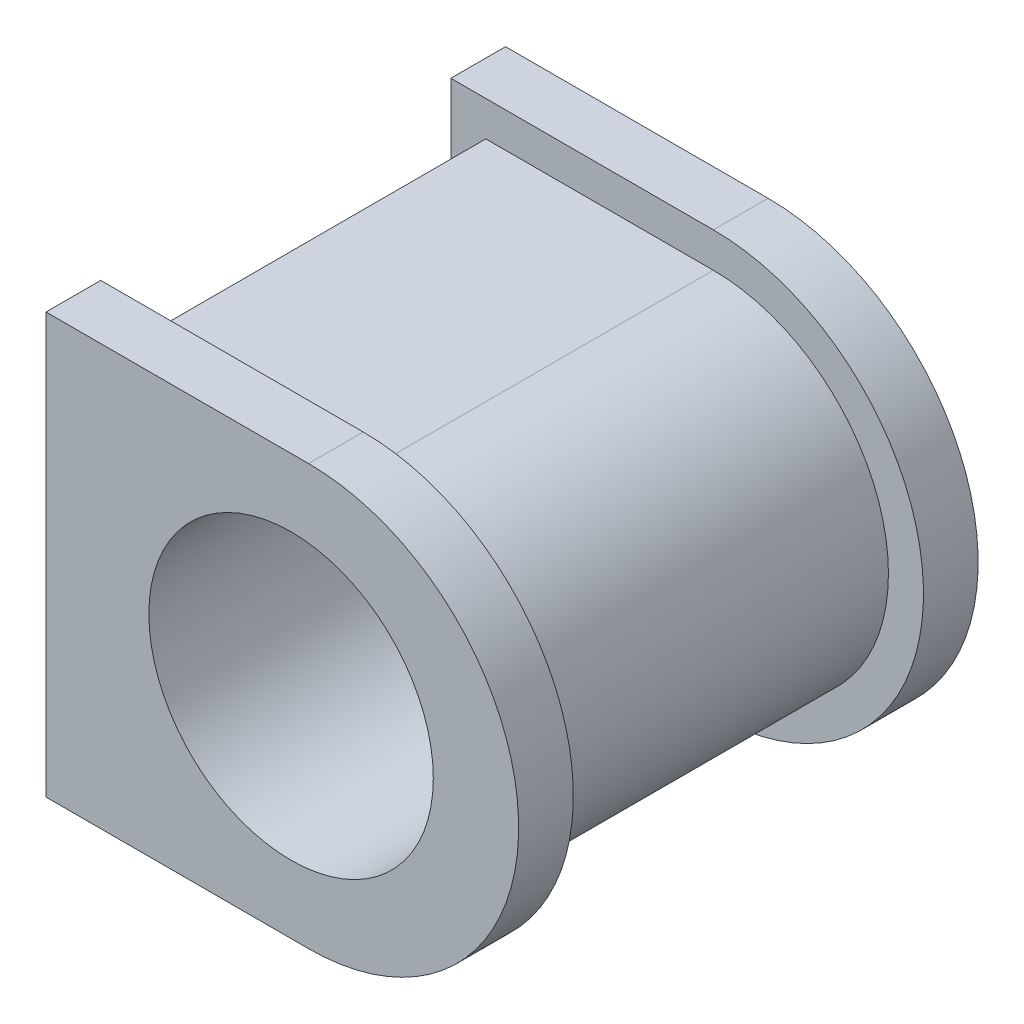
ISO-10303-21;
HEADER;
FILE_DESCRIPTION(('STEP AP214'),'2;1');
FILE_NAME('part.step','',(''),(''),'','','');
FILE_SCHEMA(('AUTOMOTIVE_DESIGN { 1 0 10303 214 1 1 1 1 }'));
ENDSEC;
DATA;
#1=APPLICATION_CONTEXT('core data for automotive mechanical design processes');
#2=APPLICATION_PROTOCOL_DEFINITION('international standard','automotive_design',2000,#1);
#3=PRODUCT_CONTEXT('',#1,'mechanical');
#4=PRODUCT('Part','Part','',(#3));
#5=PRODUCT_RELATED_PRODUCT_CATEGORY('part','',(#4));
#6=PRODUCT_DEFINITION_FORMATION('','',#4);
#7=PRODUCT_DEFINITION_CONTEXT('part definition',#1,'design');
#8=PRODUCT_DEFINITION('design','',#6,#7);
#9=PRODUCT_DEFINITION_SHAPE('','',#8);
#10=(LENGTH_UNIT() NAMED_UNIT(*) SI_UNIT(.MILLI.,.METRE.));
#11=(NAMED_UNIT(*) PLANE_ANGLE_UNIT() SI_UNIT($,.RADIAN.));
#12=(NAMED_UNIT(*) SI_UNIT($,.STERADIAN.) SOLID_ANGLE_UNIT());
#13=UNCERTAINTY_MEASURE_WITH_UNIT(LENGTH_MEASURE(1.E-05),#10,'distance_accuracy_value','');
#14=(GEOMETRIC_REPRESENTATION_CONTEXT(3) GLOBAL_UNCERTAINTY_ASSIGNED_CONTEXT((#13)) GLOBAL_UNIT_ASSIGNED_CONTEXT((#10,
#11,#12)) REPRESENTATION_CONTEXT('',''));
#15=CARTESIAN_POINT('',(0.,0.,0.));
#16=DIRECTION('',(0.,0.,1.));
#17=DIRECTION('',(1.,0.,0.));
#18=AXIS2_PLACEMENT_3D('',#15,#16,#17);
#19=CARTESIAN_POINT('',(-225.792643224085,137.875019839072,80.));
#20=DIRECTION('',(1.,0.,0.));
#21=DIRECTION('',(0.,0.,-1.));
#22=AXIS2_PLACEMENT_3D('',#19,#20,#21);
#23=PLANE('',#22);
#24=DIRECTION('',(0.,-1.,0.));
#25=VECTOR('',#24,1.);
#26=CARTESIAN_POINT('',(-225.792643224085,137.875019839072,0.));
#27=LINE('',#26,#25);
#28=CARTESIAN_POINT('',(-225.792643224085,137.875019839072,0.));
#29=VERTEX_POINT('',#28);
#30=CARTESIAN_POINT('',(-225.792643224085,57.8750198390718,0.));
#31=VERTEX_POINT('',#30);
#32=EDGE_CURVE('E218',#29,#31,#27,.T.);
#33=ORIENTED_EDGE('',*,*,#32,.T.);
#34=DIRECTION('',(0.,0.,-1.));
#35=VECTOR('',#34,1.);
#36=CARTESIAN_POINT('',(-225.792643224085,57.8750198390718,80.));
#37=LINE('',#36,#35);
#38=CARTESIAN_POINT('',(-225.792643224085,57.8750198390718,80.));
#39=VERTEX_POINT('',#38);
#40=EDGE_CURVE('E13',#39,#31,#37,.T.);
#41=ORIENTED_EDGE('',*,*,#40,.F.);
#42=DIRECTION('',(0.,-1.,0.));
#43=VECTOR('',#42,1.);
#44=CARTESIAN_POINT('',(-225.792643224085,137.875019839072,80.));
#45=LINE('',#44,#43);
#46=CARTESIAN_POINT('',(-225.792643224085,137.875019839072,80.));
#47=VERTEX_POINT('',#46);
#48=EDGE_CURVE('E219',#47,#39,#45,.T.);
#49=ORIENTED_EDGE('',*,*,#48,.F.);
#50=DIRECTION('',(0.,0.,-1.));
#51=VECTOR('',#50,1.);
#52=CARTESIAN_POINT('',(-225.792643224085,137.875019839072,80.));
#53=LINE('',#52,#51);
#54=EDGE_CURVE('E236',#47,#29,#53,.T.);
#55=ORIENTED_EDGE('',*,*,#54,.T.);
#56=EDGE_LOOP('',(#33,#41,#49,#55));
#57=FACE_BOUND('',#56,.T.);
#58=ADVANCED_FACE('F51',(#57),#23,.F.);
#59=CARTESIAN_POINT('',(-225.792643224085,57.8750198390718,80.));
#60=DIRECTION('',(0.,1.,0.));
#61=DIRECTION('',(0.,0.,1.));
#62=AXIS2_PLACEMENT_3D('',#59,#60,#61);
#63=PLANE('',#62);
#64=DIRECTION('',(1.,0.,0.));
#65=VECTOR('',#64,1.);
#66=CARTESIAN_POINT('',(-225.792643224085,57.8750198390718,0.));
#67=LINE('',#66,#65);
#68=CARTESIAN_POINT('',(-173.792643224085,57.8750198390718,0.));
#69=VERTEX_POINT('',#68);
#70=EDGE_CURVE('E240',#31,#69,#67,.T.);
#71=ORIENTED_EDGE('',*,*,#70,.T.);
#72=DIRECTION('',(0.,0.,-1.));
#73=VECTOR('',#72,1.);
#74=CARTESIAN_POINT('',(-173.792643224085,57.8750198390718,80.));
#75=LINE('',#74,#73);
#76=CARTESIAN_POINT('',(-173.792643224085,57.8750198390718,80.));
#77=VERTEX_POINT('',#76);
#78=EDGE_CURVE('E60',#77,#69,#75,.T.);
#79=ORIENTED_EDGE('',*,*,#78,.F.);
#80=DIRECTION('',(1.,0.,0.));
#81=VECTOR('',#80,1.);
#82=CARTESIAN_POINT('',(-225.792643224085,57.8750198390718,80.));
#83=LINE('',#82,#81);
#84=EDGE_CURVE('E223',#39,#77,#83,.T.);
#85=ORIENTED_EDGE('',*,*,#84,.F.);
#86=ORIENTED_EDGE('',*,*,#40,.T.);
#87=EDGE_LOOP('',(#71,#79,#85,#86));
#88=FACE_BOUND('',#87,.T.);
#89=ADVANCED_FACE('F260',(#88),#63,.F.);
#90=CARTESIAN_POINT('',(-173.792643224085,97.8750198390718,80.));
#91=DIRECTION('',(0.,0.,-1.));
#92=DIRECTION('',(-1.,0.,0.));
#93=AXIS2_PLACEMENT_3D('',#90,#91,#92);
#94=CYLINDRICAL_SURFACE('',#93,40.);
#95=CARTESIAN_POINT('',(-173.792643224085,97.8750198390718,0.));
#96=DIRECTION('',(0.,0.,1.));
#97=DIRECTION('',(1.,0.,0.));
#98=AXIS2_PLACEMENT_3D('',#95,#96,#97);
#99=CIRCLE('',#98,40.);
#100=CARTESIAN_POINT('',(-173.792643224085,137.875019839072,0.));
#101=VERTEX_POINT('',#100);
#102=EDGE_CURVE('E244',#69,#101,#99,.T.);
#103=ORIENTED_EDGE('',*,*,#102,.T.);
#104=DIRECTION('',(0.,0.,-1.));
#105=VECTOR('',#104,1.);
#106=CARTESIAN_POINT('',(-173.792643224085,137.875019839072,80.));
#107=LINE('',#106,#105);
#108=CARTESIAN_POINT('',(-173.792643224085,137.875019839072,80.));
#109=VERTEX_POINT('',#108);
#110=EDGE_CURVE('E67',#109,#101,#107,.T.);
#111=ORIENTED_EDGE('',*,*,#110,.F.);
#112=CARTESIAN_POINT('',(-173.792643224085,97.8750198390718,80.));
#113=DIRECTION('',(0.,0.,1.));
#114=DIRECTION('',(1.,0.,0.));
#115=AXIS2_PLACEMENT_3D('',#112,#113,#114);
#116=CIRCLE('',#115,40.);
#117=EDGE_CURVE('E228',#77,#109,#116,.T.);
#118=ORIENTED_EDGE('',*,*,#117,.F.);
#119=ORIENTED_EDGE('',*,*,#78,.T.);
#120=EDGE_LOOP('',(#103,#111,#118,#119));
#121=FACE_BOUND('',#120,.T.);
#122=ADVANCED_FACE('F257',(#121),#94,.T.);
#123=CARTESIAN_POINT('',(-225.792643224085,137.875019839072,80.));
#124=DIRECTION('',(0.,-1.,0.));
#125=DIRECTION('',(0.,0.,-1.));
#126=AXIS2_PLACEMENT_3D('',#123,#124,#125);
#127=PLANE('',#126);
#128=DIRECTION('',(-1.,0.,0.));
#129=VECTOR('',#128,1.);
#130=CARTESIAN_POINT('',(-225.792643224085,137.875019839072,0.));
#131=LINE('',#130,#129);
#132=EDGE_CURVE('E224',#101,#29,#131,.T.);
#133=ORIENTED_EDGE('',*,*,#132,.T.);
#134=ORIENTED_EDGE('',*,*,#54,.F.);
#135=DIRECTION('',(-1.,0.,0.));
#136=VECTOR('',#135,1.);
#137=CARTESIAN_POINT('',(-225.792643224085,137.875019839072,80.));
#138=LINE('',#137,#136);
#139=EDGE_CURVE('E232',#109,#47,#138,.T.);
#140=ORIENTED_EDGE('',*,*,#139,.F.);
#141=ORIENTED_EDGE('',*,*,#110,.T.);
#142=EDGE_LOOP('',(#133,#134,#140,#141));
#143=FACE_BOUND('',#142,.T.);
#144=ADVANCED_FACE('F267',(#143),#127,.F.);
#145=CARTESIAN_POINT('',(-177.792643224085,97.8750198390718,80.));
#146=DIRECTION('',(0.,0.,-1.));
#147=DIRECTION('',(-1.,0.,0.));
#148=AXIS2_PLACEMENT_3D('',#145,#146,#147);
#149=CYLINDRICAL_SURFACE('',#148,32.5);
#150=CARTESIAN_POINT('',(-177.792643224085,97.8750198390718,92.5));
#151=DIRECTION('',(0.,0.,1.));
#152=DIRECTION('',(1.,0.,0.));
#153=AXIS2_PLACEMENT_3D('',#150,#151,#152);
#154=CIRCLE('',#153,32.5);
#155=CARTESIAN_POINT('',(-145.292643224085,97.8750198390718,92.5));
#156=VERTEX_POINT('',#155);
#157=EDGE_CURVE('E192',#156,#156,#154,.F.);
#158=ORIENTED_EDGE('',*,*,#157,.F.);
#159=EDGE_LOOP('',(#158));
#160=FACE_BOUND('',#159,.T.);
#161=CARTESIAN_POINT('',(-177.792643224085,97.8750198390718,-12.5));
#162=DIRECTION('',(0.,0.,-1.));
#163=DIRECTION('',(-1.,0.,0.));
#164=AXIS2_PLACEMENT_3D('',#161,#162,#163);
#165=CIRCLE('',#164,32.5);
#166=CARTESIAN_POINT('',(-210.292643224085,97.8750198390718,-12.5));
#167=VERTEX_POINT('',#166);
#168=EDGE_CURVE('E328',#167,#167,#165,.T.);
#169=ORIENTED_EDGE('',*,*,#168,.T.);
#170=EDGE_LOOP('',(#169));
#171=FACE_BOUND('',#170,.T.);
#172=ADVANCED_FACE('F273',(#160,#171),#149,.F.);
#173=CARTESIAN_POINT('',(0.,0.,80.));
#174=DIRECTION('',(0.,0.,1.));
#175=DIRECTION('',(1.,0.,0.));
#176=AXIS2_PLACEMENT_3D('',#173,#174,#175);
#177=PLANE('',#176);
#178=DIRECTION('',(-1.,0.,0.));
#179=VECTOR('',#178,1.);
#180=CARTESIAN_POINT('',(0.,49.8750198390718,80.));
#181=LINE('',#180,#179);
#182=CARTESIAN_POINT('',(-173.792643224085,49.8750198390718,80.));
#183=VERTEX_POINT('',#182);
#184=CARTESIAN_POINT('',(-233.792643224085,49.8750198390718,80.));
#185=VERTEX_POINT('',#184);
#186=EDGE_CURVE('E166',#183,#185,#181,.T.);
#187=ORIENTED_EDGE('',*,*,#186,.T.);
#188=DIRECTION('',(0.,-1.,0.));
#189=VECTOR('',#188,1.);
#190=CARTESIAN_POINT('',(-233.792643224085,0.,80.));
#191=LINE('',#190,#189);
#192=CARTESIAN_POINT('',(-233.792643224085,145.875019839072,80.));
#193=VERTEX_POINT('',#192);
#194=EDGE_CURVE('E183',#193,#185,#191,.T.);
#195=ORIENTED_EDGE('',*,*,#194,.F.);
#196=DIRECTION('',(-1.,0.,0.));
#197=VECTOR('',#196,1.);
#198=CARTESIAN_POINT('',(0.,145.875019839072,80.));
#199=LINE('',#198,#197);
#200=CARTESIAN_POINT('',(-173.792643224085,145.875019839072,80.));
#201=VERTEX_POINT('',#200);
#202=EDGE_CURVE('E199',#201,#193,#199,.T.);
#203=ORIENTED_EDGE('',*,*,#202,.F.);
#204=CARTESIAN_POINT('',(-173.792643224085,97.8750198390718,80.));
#205=DIRECTION('',(0.,0.,1.));
#206=DIRECTION('',(1.,0.,0.));
#207=AXIS2_PLACEMENT_3D('',#204,#205,#206);
#208=CIRCLE('',#207,48.);
#209=EDGE_CURVE('E172',#183,#201,#208,.T.);
#210=ORIENTED_EDGE('',*,*,#209,.F.);
#211=EDGE_LOOP('',(#187,#195,#203,#210));
#212=FACE_BOUND('',#211,.T.);
#213=ORIENTED_EDGE('',*,*,#139,.T.);
#214=ORIENTED_EDGE('',*,*,#48,.T.);
#215=ORIENTED_EDGE('',*,*,#84,.T.);
#216=ORIENTED_EDGE('',*,*,#117,.T.);
#217=EDGE_LOOP('',(#213,#214,#215,#216));
#218=FACE_BOUND('',#217,.T.);
#219=ADVANCED_FACE('F270',(#212,#218),#177,.F.);
#220=CARTESIAN_POINT('',(0.,49.8750198390718,92.5));
#221=DIRECTION('',(0.,-1.,0.));
#222=DIRECTION('',(1.,0.,0.));
#223=AXIS2_PLACEMENT_3D('',#220,#221,#222);
#224=PLANE('',#223);
#225=ORIENTED_EDGE('',*,*,#186,.F.);
#226=DIRECTION('',(0.,0.,-1.));
#227=VECTOR('',#226,1.);
#228=CARTESIAN_POINT('',(-173.792643224085,49.8750198390718,92.5));
#229=LINE('',#228,#227);
#230=CARTESIAN_POINT('',(-173.792643224085,49.8750198390718,92.5));
#231=VERTEX_POINT('',#230);
#232=EDGE_CURVE('E215',#231,#183,#229,.T.);
#233=ORIENTED_EDGE('',*,*,#232,.F.);
#234=DIRECTION('',(-1.,0.,0.));
#235=VECTOR('',#234,1.);
#236=CARTESIAN_POINT('',(0.,49.8750198390718,92.5));
#237=LINE('',#236,#235);
#238=CARTESIAN_POINT('',(-233.792643224085,49.8750198390718,92.5));
#239=VERTEX_POINT('',#238);
#240=EDGE_CURVE('E178',#231,#239,#237,.T.);
#241=ORIENTED_EDGE('',*,*,#240,.T.);
#242=DIRECTION('',(0.,0.,-1.));
#243=VECTOR('',#242,1.);
#244=CARTESIAN_POINT('',(-233.792643224085,49.8750198390718,92.5));
#245=LINE('',#244,#243);
#246=EDGE_CURVE('E195',#239,#185,#245,.T.);
#247=ORIENTED_EDGE('',*,*,#246,.T.);
#248=EDGE_LOOP('',(#225,#233,#241,#247));
#249=FACE_BOUND('',#248,.T.);
#250=ADVANCED_FACE('F272',(#249),#224,.T.);
#251=CARTESIAN_POINT('',(-173.792643224085,97.8750198390718,92.5));
#252=DIRECTION('',(0.,0.,-1.));
#253=DIRECTION('',(-1.,0.,0.));
#254=AXIS2_PLACEMENT_3D('',#251,#252,#253);
#255=CYLINDRICAL_SURFACE('',#254,48.);
#256=ORIENTED_EDGE('',*,*,#209,.T.);
#257=DIRECTION('',(0.,0.,-1.));
#258=VECTOR('',#257,1.);
#259=CARTESIAN_POINT('',(-173.792643224085,145.875019839072,92.5));
#260=LINE('',#259,#258);
#261=CARTESIAN_POINT('',(-173.792643224085,145.875019839072,92.5));
#262=VERTEX_POINT('',#261);
#263=EDGE_CURVE('E211',#262,#201,#260,.T.);
#264=ORIENTED_EDGE('',*,*,#263,.F.);
#265=CARTESIAN_POINT('',(-173.792643224085,97.8750198390718,92.5));
#266=DIRECTION('',(0.,0.,1.));
#267=DIRECTION('',(1.,0.,0.));
#268=AXIS2_PLACEMENT_3D('',#265,#266,#267);
#269=CIRCLE('',#268,48.);
#270=EDGE_CURVE('E182',#231,#262,#269,.T.);
#271=ORIENTED_EDGE('',*,*,#270,.F.);
#272=ORIENTED_EDGE('',*,*,#232,.T.);
#273=EDGE_LOOP('',(#256,#264,#271,#272));
#274=FACE_BOUND('',#273,.T.);
#275=ADVANCED_FACE('F280',(#274),#255,.T.);
#276=CARTESIAN_POINT('',(0.,145.875019839072,92.5));
#277=DIRECTION('',(0.,-1.,0.));
#278=DIRECTION('',(1.,0.,0.));
#279=AXIS2_PLACEMENT_3D('',#276,#277,#278);
#280=PLANE('',#279);
#281=ORIENTED_EDGE('',*,*,#202,.T.);
#282=DIRECTION('',(0.,0.,-1.));
#283=VECTOR('',#282,1.);
#284=CARTESIAN_POINT('',(-233.792643224085,145.875019839072,92.5));
#285=LINE('',#284,#283);
#286=CARTESIAN_POINT('',(-233.792643224085,145.875019839072,92.5));
#287=VERTEX_POINT('',#286);
#288=EDGE_CURVE('E207',#287,#193,#285,.T.);
#289=ORIENTED_EDGE('',*,*,#288,.F.);
#290=DIRECTION('',(-1.,0.,0.));
#291=VECTOR('',#290,1.);
#292=CARTESIAN_POINT('',(0.,145.875019839072,92.5));
#293=LINE('',#292,#291);
#294=EDGE_CURVE('E186',#262,#287,#293,.T.);
#295=ORIENTED_EDGE('',*,*,#294,.F.);
#296=ORIENTED_EDGE('',*,*,#263,.T.);
#297=EDGE_LOOP('',(#281,#289,#295,#296));
#298=FACE_BOUND('',#297,.T.);
#299=ADVANCED_FACE('F300',(#298),#280,.F.);
#300=CARTESIAN_POINT('',(-233.792643224085,0.,92.5));
#301=DIRECTION('',(1.,0.,0.));
#302=DIRECTION('',(0.,0.,-1.));
#303=AXIS2_PLACEMENT_3D('',#300,#301,#302);
#304=PLANE('',#303);
#305=ORIENTED_EDGE('',*,*,#194,.T.);
#306=ORIENTED_EDGE('',*,*,#246,.F.);
#307=DIRECTION('',(0.,-1.,0.));
#308=VECTOR('',#307,1.);
#309=CARTESIAN_POINT('',(-233.792643224085,0.,92.5));
#310=LINE('',#309,#308);
#311=EDGE_CURVE('E189',#287,#239,#310,.T.);
#312=ORIENTED_EDGE('',*,*,#311,.F.);
#313=ORIENTED_EDGE('',*,*,#288,.T.);
#314=EDGE_LOOP('',(#305,#306,#312,#313));
#315=FACE_BOUND('',#314,.T.);
#316=ADVANCED_FACE('F303',(#315),#304,.F.);
#317=CARTESIAN_POINT('',(0.,0.,92.5));
#318=DIRECTION('',(0.,0.,1.));
#319=DIRECTION('',(1.,0.,0.));
#320=AXIS2_PLACEMENT_3D('',#317,#318,#319);
#321=PLANE('',#320);
#322=ORIENTED_EDGE('',*,*,#240,.F.);
#323=ORIENTED_EDGE('',*,*,#270,.T.);
#324=ORIENTED_EDGE('',*,*,#294,.T.);
#325=ORIENTED_EDGE('',*,*,#311,.T.);
#326=EDGE_LOOP('',(#322,#323,#324,#325));
#327=FACE_BOUND('',#326,.T.);
#328=ORIENTED_EDGE('',*,*,#157,.T.);
#329=EDGE_LOOP('',(#328));
#330=FACE_BOUND('',#329,.T.);
#331=ADVANCED_FACE('F306',(#327,#330),#321,.T.);
#332=CARTESIAN_POINT('',(-173.792643224085,97.8750198390718,-12.5));
#333=DIRECTION('',(0.,0.,-1.));
#334=DIRECTION('',(-1.,0.,0.));
#335=AXIS2_PLACEMENT_3D('',#332,#333,#334);
#336=PLANE('',#335);
#337=DIRECTION('',(0.,1.,0.));
#338=VECTOR('',#337,1.);
#339=CARTESIAN_POINT('',(-233.792643224085,145.875019839072,-12.5));
#340=LINE('',#339,#338);
#341=CARTESIAN_POINT('',(-233.792643224085,49.8750198390718,-12.5));
#342=VERTEX_POINT('',#341);
#343=CARTESIAN_POINT('',(-233.792643224085,145.875019839072,-12.5));
#344=VERTEX_POINT('',#343);
#345=EDGE_CURVE('E149',#342,#344,#340,.T.);
#346=ORIENTED_EDGE('',*,*,#345,.T.);
#347=DIRECTION('',(1.,0.,0.));
#348=VECTOR('',#347,1.);
#349=CARTESIAN_POINT('',(-233.792643224085,145.875019839072,-12.5));
#350=LINE('',#349,#348);
#351=CARTESIAN_POINT('',(-173.792643224085,145.875019839072,-12.5));
#352=VERTEX_POINT('',#351);
#353=EDGE_CURVE('E137',#344,#352,#350,.T.);
#354=ORIENTED_EDGE('',*,*,#353,.T.);
#355=CARTESIAN_POINT('',(-173.792643224085,97.8750198390718,-12.5));
#356=DIRECTION('',(0.,0.,-1.));
#357=DIRECTION('',(-1.,0.,0.));
#358=AXIS2_PLACEMENT_3D('',#355,#356,#357);
#359=CIRCLE('',#358,48.);
#360=CARTESIAN_POINT('',(-173.792643224085,49.8750198390718,-12.5));
#361=VERTEX_POINT('',#360);
#362=EDGE_CURVE('E148',#352,#361,#359,.T.);
#363=ORIENTED_EDGE('',*,*,#362,.T.);
#364=DIRECTION('',(-1.,0.,0.));
#365=VECTOR('',#364,1.);
#366=CARTESIAN_POINT('',(-233.792643224085,49.8750198390718,-12.5));
#367=LINE('',#366,#365);
#368=EDGE_CURVE('E155',#361,#342,#367,.T.);
#369=ORIENTED_EDGE('',*,*,#368,.T.);
#370=EDGE_LOOP('',(#346,#354,#363,#369));
#371=FACE_BOUND('',#370,.T.);
#372=ORIENTED_EDGE('',*,*,#168,.F.);
#373=EDGE_LOOP('',(#372));
#374=FACE_BOUND('',#373,.T.);
#375=ADVANCED_FACE('F152',(#371,#374),#336,.T.);
#376=CARTESIAN_POINT('',(-173.792643224085,97.8750198390718,0.));
#377=DIRECTION('',(0.,0.,-1.));
#378=DIRECTION('',(-1.,0.,0.));
#379=AXIS2_PLACEMENT_3D('',#376,#377,#378);
#380=PLANE('',#379);
#381=ORIENTED_EDGE('',*,*,#32,.F.);
#382=ORIENTED_EDGE('',*,*,#132,.F.);
#383=ORIENTED_EDGE('',*,*,#102,.F.);
#384=ORIENTED_EDGE('',*,*,#70,.F.);
#385=EDGE_LOOP('',(#381,#382,#383,#384));
#386=FACE_BOUND('',#385,.T.);
#387=DIRECTION('',(0.,1.,0.));
#388=VECTOR('',#387,1.);
#389=CARTESIAN_POINT('',(-233.792643224085,145.875019839072,0.));
#390=LINE('',#389,#388);
#391=CARTESIAN_POINT('',(-233.792643224085,49.8750198390718,0.));
#392=VERTEX_POINT('',#391);
#393=CARTESIAN_POINT('',(-233.792643224085,145.875019839072,0.));
#394=VERTEX_POINT('',#393);
#395=EDGE_CURVE('E164',#392,#394,#390,.T.);
#396=ORIENTED_EDGE('',*,*,#395,.F.);
#397=DIRECTION('',(-1.,0.,0.));
#398=VECTOR('',#397,1.);
#399=CARTESIAN_POINT('',(-233.792643224085,49.8750198390718,0.));
#400=LINE('',#399,#398);
#401=CARTESIAN_POINT('',(-173.792643224085,49.8750198390718,0.));
#402=VERTEX_POINT('',#401);
#403=EDGE_CURVE('E160',#402,#392,#400,.T.);
#404=ORIENTED_EDGE('',*,*,#403,.F.);
#405=CARTESIAN_POINT('',(-173.792643224085,97.8750198390718,0.));
#406=DIRECTION('',(0.,0.,-1.));
#407=DIRECTION('',(-1.,0.,0.));
#408=AXIS2_PLACEMENT_3D('',#405,#406,#407);
#409=CIRCLE('',#408,48.);
#410=CARTESIAN_POINT('',(-173.792643224085,145.875019839072,0.));
#411=VERTEX_POINT('',#410);
#412=EDGE_CURVE('E343',#411,#402,#409,.T.);
#413=ORIENTED_EDGE('',*,*,#412,.F.);
#414=DIRECTION('',(1.,0.,0.));
#415=VECTOR('',#414,1.);
#416=CARTESIAN_POINT('',(-233.792643224085,145.875019839072,0.));
#417=LINE('',#416,#415);
#418=EDGE_CURVE('E333',#394,#411,#417,.T.);
#419=ORIENTED_EDGE('',*,*,#418,.F.);
#420=EDGE_LOOP('',(#396,#404,#413,#419));
#421=FACE_BOUND('',#420,.T.);
#422=ADVANCED_FACE('F263',(#386,#421),#380,.F.);
#423=CARTESIAN_POINT('',(-233.792643224085,145.875019839072,-12.5));
#424=DIRECTION('',(1.,0.,0.));
#425=DIRECTION('',(0.,0.,-1.));
#426=AXIS2_PLACEMENT_3D('',#423,#424,#425);
#427=PLANE('',#426);
#428=ORIENTED_EDGE('',*,*,#395,.T.);
#429=DIRECTION('',(0.,0.,1.));
#430=VECTOR('',#429,1.);
#431=CARTESIAN_POINT('',(-233.792643224085,145.875019839072,-12.5));
#432=LINE('',#431,#430);
#433=EDGE_CURVE('E141',#344,#394,#432,.T.);
#434=ORIENTED_EDGE('',*,*,#433,.F.);
#435=ORIENTED_EDGE('',*,*,#345,.F.);
#436=DIRECTION('',(0.,0.,1.));
#437=VECTOR('',#436,1.);
#438=CARTESIAN_POINT('',(-233.792643224085,49.8750198390718,-12.5));
#439=LINE('',#438,#437);
#440=EDGE_CURVE('E339',#342,#392,#439,.T.);
#441=ORIENTED_EDGE('',*,*,#440,.T.);
#442=EDGE_LOOP('',(#428,#434,#435,#441));
#443=FACE_BOUND('',#442,.T.);
#444=ADVANCED_FACE('F162',(#443),#427,.F.);
#445=CARTESIAN_POINT('',(-233.792643224085,145.875019839072,-12.5));
#446=DIRECTION('',(0.,-1.,0.));
#447=DIRECTION('',(1.,0.,0.));
#448=AXIS2_PLACEMENT_3D('',#445,#446,#447);
#449=PLANE('',#448);
#450=ORIENTED_EDGE('',*,*,#418,.T.);
#451=DIRECTION('',(0.,0.,1.));
#452=VECTOR('',#451,1.);
#453=CARTESIAN_POINT('',(-173.792643224085,145.875019839072,-12.5));
#454=LINE('',#453,#452);
#455=EDGE_CURVE('E144',#352,#411,#454,.T.);
#456=ORIENTED_EDGE('',*,*,#455,.F.);
#457=ORIENTED_EDGE('',*,*,#353,.F.);
#458=ORIENTED_EDGE('',*,*,#433,.T.);
#459=EDGE_LOOP('',(#450,#456,#457,#458));
#460=FACE_BOUND('',#459,.T.);
#461=ADVANCED_FACE('F139',(#460),#449,.F.);
#462=CARTESIAN_POINT('',(-173.792643224085,97.8750198390718,-12.5));
#463=DIRECTION('',(0.,0.,1.));
#464=DIRECTION('',(1.,0.,0.));
#465=AXIS2_PLACEMENT_3D('',#462,#463,#464);
#466=CYLINDRICAL_SURFACE('',#465,48.);
#467=ORIENTED_EDGE('',*,*,#412,.T.);
#468=DIRECTION('',(0.,0.,1.));
#469=VECTOR('',#468,1.);
#470=CARTESIAN_POINT('',(-173.792643224085,49.8750198390718,-12.5));
#471=LINE('',#470,#469);
#472=EDGE_CURVE('E174',#361,#402,#471,.T.);
#473=ORIENTED_EDGE('',*,*,#472,.F.);
#474=ORIENTED_EDGE('',*,*,#362,.F.);
#475=ORIENTED_EDGE('',*,*,#455,.T.);
#476=EDGE_LOOP('',(#467,#473,#474,#475));
#477=FACE_BOUND('',#476,.T.);
#478=ADVANCED_FACE('F358',(#477),#466,.T.);
#479=CARTESIAN_POINT('',(-233.792643224085,49.8750198390718,-12.5));
#480=DIRECTION('',(0.,1.,0.));
#481=DIRECTION('',(-1.,0.,0.));
#482=AXIS2_PLACEMENT_3D('',#479,#480,#481);
#483=PLANE('',#482);
#484=ORIENTED_EDGE('',*,*,#403,.T.);
#485=ORIENTED_EDGE('',*,*,#440,.F.);
#486=ORIENTED_EDGE('',*,*,#368,.F.);
#487=ORIENTED_EDGE('',*,*,#472,.T.);
#488=EDGE_LOOP('',(#484,#485,#486,#487));
#489=FACE_BOUND('',#488,.T.);
#490=ADVANCED_FACE('F355',(#489),#483,.F.);
#491=CLOSED_SHELL('',(#58,#89,#122,#144,#172,#219,#250,#275,#299,#316,#331,#375,#422,#444,#461,
#478,#490));
#492=MANIFOLD_SOLID_BREP('B2',#491);
#493=ADVANCED_BREP_SHAPE_REPRESENTATION('',(#18,#492),#14);
#494=SHAPE_DEFINITION_REPRESENTATION(#9,#493);
ENDSEC;
END-ISO-10303-21;
